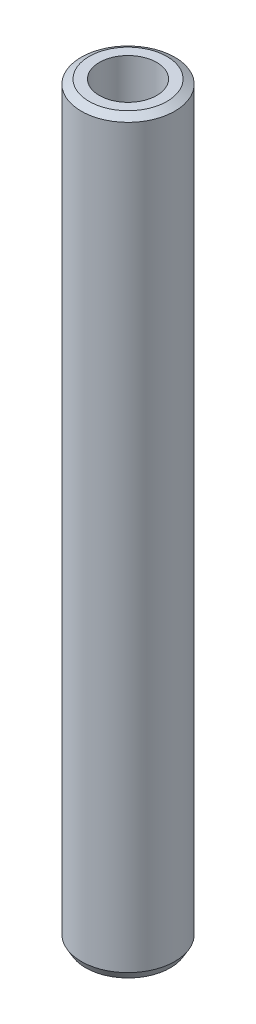
ISO-10303-21;
HEADER;
FILE_DESCRIPTION(('STEP AP214'),'2;1');
FILE_NAME('part.step','',(''),(''),'','','');
FILE_SCHEMA(('AUTOMOTIVE_DESIGN { 1 0 10303 214 1 1 1 1 }'));
ENDSEC;
DATA;
#1=APPLICATION_CONTEXT('core data for automotive mechanical design processes');
#2=APPLICATION_PROTOCOL_DEFINITION('international standard','automotive_design',2000,#1);
#3=PRODUCT_CONTEXT('',#1,'mechanical');
#4=PRODUCT('Part','Part','',(#3));
#5=PRODUCT_RELATED_PRODUCT_CATEGORY('part','',(#4));
#6=PRODUCT_DEFINITION_FORMATION('','',#4);
#7=PRODUCT_DEFINITION_CONTEXT('part definition',#1,'design');
#8=PRODUCT_DEFINITION('design','',#6,#7);
#9=PRODUCT_DEFINITION_SHAPE('','',#8);
#10=(LENGTH_UNIT() NAMED_UNIT(*) SI_UNIT(.MILLI.,.METRE.));
#11=(NAMED_UNIT(*) PLANE_ANGLE_UNIT() SI_UNIT($,.RADIAN.));
#12=(NAMED_UNIT(*) SI_UNIT($,.STERADIAN.) SOLID_ANGLE_UNIT());
#13=UNCERTAINTY_MEASURE_WITH_UNIT(LENGTH_MEASURE(1.E-05),#10,'distance_accuracy_value','');
#14=(GEOMETRIC_REPRESENTATION_CONTEXT(3) GLOBAL_UNCERTAINTY_ASSIGNED_CONTEXT((#13)) GLOBAL_UNIT_ASSIGNED_CONTEXT((#10,
#11,#12)) REPRESENTATION_CONTEXT('',''));
#15=CARTESIAN_POINT('',(0.,0.,0.));
#16=DIRECTION('',(0.,0.,1.));
#17=DIRECTION('',(1.,0.,0.));
#18=AXIS2_PLACEMENT_3D('',#15,#16,#17);
#19=CARTESIAN_POINT('',(0.,600.,0.));
#20=DIRECTION('',(0.,-1.,0.));
#21=DIRECTION('',(0.,0.,-1.));
#22=AXIS2_PLACEMENT_3D('',#19,#20,#21);
#23=CYLINDRICAL_SURFACE('',#22,37.5);
#24=CARTESIAN_POINT('',(0.,596.367724534211,0.));
#25=DIRECTION('',(0.,1.,0.));
#26=DIRECTION('',(0.,0.,1.));
#27=AXIS2_PLACEMENT_3D('',#24,#25,#26);
#28=CIRCLE('',#27,37.5);
#29=CARTESIAN_POINT('',(0.,596.367724534211,-37.5));
#30=VERTEX_POINT('',#29);
#31=EDGE_CURVE('E50',#30,#30,#28,.F.);
#32=CARTESIAN_POINT('',(0.,6.2912856538313,0.));
#33=DIRECTION('',(0.,1.,0.));
#34=DIRECTION('',(0.,0.,1.));
#35=AXIS2_PLACEMENT_3D('',#32,#33,#34);
#36=CIRCLE('',#35,37.5);
#37=CARTESIAN_POINT('',(0.,6.29128565383119,-37.5));
#38=VERTEX_POINT('',#37);
#39=EDGE_CURVE('E51',#38,#38,#36,.T.);
#40=CARTESIAN_POINT('',(0.,596.367724534211,-37.5));
#41=CARTESIAN_POINT('',(0.,590.221094962541,-37.5));
#42=CARTESIAN_POINT('',(0.,584.07446539087,-37.5));
#43=CARTESIAN_POINT('',(0.,571.781206247529,-37.5));
#44=CARTESIAN_POINT('',(0.,565.634576675858,-37.5));
#45=CARTESIAN_POINT('',(0.,553.341317532517,-37.5));
#46=CARTESIAN_POINT('',(0.,547.194687960847,-37.5));
#47=CARTESIAN_POINT('',(0.,534.901428817505,-37.5));
#48=CARTESIAN_POINT('',(0.,528.754799245835,-37.5));
#49=CARTESIAN_POINT('',(0.,516.461540102493,-37.5));
#50=CARTESIAN_POINT('',(0.,510.314910530823,-37.5));
#51=CARTESIAN_POINT('',(0.,498.021651387481,-37.5));
#52=CARTESIAN_POINT('',(0.,491.875021815811,-37.5));
#53=CARTESIAN_POINT('',(0.,479.581762672469,-37.5));
#54=CARTESIAN_POINT('',(0.,473.435133100799,-37.5));
#55=CARTESIAN_POINT('',(0.,461.141873957458,-37.5));
#56=CARTESIAN_POINT('',(0.,454.995244385787,-37.5));
#57=CARTESIAN_POINT('',(0.,442.701985242446,-37.5));
#58=CARTESIAN_POINT('',(0.,436.555355670775,-37.5));
#59=CARTESIAN_POINT('',(0.,424.262096527434,-37.5));
#60=CARTESIAN_POINT('',(0.,418.115466955763,-37.5));
#61=CARTESIAN_POINT('',(0.,405.822207812422,-37.5));
#62=CARTESIAN_POINT('',(0.,399.675578240751,-37.5));
#63=CARTESIAN_POINT('',(0.,387.38231909741,-37.5));
#64=CARTESIAN_POINT('',(0.,381.235689525739,-37.5));
#65=CARTESIAN_POINT('',(0.,368.942430382398,-37.5));
#66=CARTESIAN_POINT('',(0.,362.795800810728,-37.5));
#67=CARTESIAN_POINT('',(0.,350.502541667386,-37.5));
#68=CARTESIAN_POINT('',(0.,344.355912095716,-37.5));
#69=CARTESIAN_POINT('',(0.,332.062652952374,-37.5));
#70=CARTESIAN_POINT('',(0.,325.916023380704,-37.5));
#71=CARTESIAN_POINT('',(0.,313.622764237363,-37.5));
#72=CARTESIAN_POINT('',(0.,307.476134665692,-37.5));
#73=CARTESIAN_POINT('',(0.,295.182875522351,-37.5));
#74=CARTESIAN_POINT('',(0.,289.03624595068,-37.5));
#75=CARTESIAN_POINT('',(0.,276.742986807339,-37.5));
#76=CARTESIAN_POINT('',(0.,270.596357235668,-37.5));
#77=CARTESIAN_POINT('',(0.,258.303098092327,-37.5));
#78=CARTESIAN_POINT('',(0.,252.156468520656,-37.5));
#79=CARTESIAN_POINT('',(0.,239.863209377315,-37.5));
#80=CARTESIAN_POINT('',(0.,233.716579805644,-37.5));
#81=CARTESIAN_POINT('',(0.,221.423320662303,-37.5));
#82=CARTESIAN_POINT('',(0.,215.276691090632,-37.5));
#83=CARTESIAN_POINT('',(0.,202.983431947291,-37.5));
#84=CARTESIAN_POINT('',(0.,196.836802375621,-37.5));
#85=CARTESIAN_POINT('',(0.,184.543543232279,-37.5));
#86=CARTESIAN_POINT('',(0.,178.396913660609,-37.5));
#87=CARTESIAN_POINT('',(0.,166.103654517267,-37.5));
#88=CARTESIAN_POINT('',(0.,159.957024945597,-37.5));
#89=CARTESIAN_POINT('',(0.,147.663765802256,-37.5));
#90=CARTESIAN_POINT('',(0.,141.517136230585,-37.5));
#91=CARTESIAN_POINT('',(0.,129.223877087244,-37.5));
#92=CARTESIAN_POINT('',(0.,123.077247515573,-37.5));
#93=CARTESIAN_POINT('',(0.,110.783988372232,-37.5));
#94=CARTESIAN_POINT('',(0.,104.637358800561,-37.5));
#95=CARTESIAN_POINT('',(0.,92.34409965722,-37.5));
#96=CARTESIAN_POINT('',(0.,86.1974700855494,-37.5));
#97=CARTESIAN_POINT('',(0.,73.9042109422082,-37.5));
#98=CARTESIAN_POINT('',(0.,67.7575813705375,-37.5));
#99=CARTESIAN_POINT('',(0.,55.4643222271963,-37.5));
#100=CARTESIAN_POINT('',(0.,49.3176926555256,-37.5));
#101=CARTESIAN_POINT('',(0.,37.0244335121844,-37.5));
#102=CARTESIAN_POINT('',(0.,30.8778039405137,-37.5));
#103=CARTESIAN_POINT('',(0.,18.5845447971725,-37.5));
#104=CARTESIAN_POINT('',(0.,12.4379152255018,-37.5));
#105=CARTESIAN_POINT('',(0.,6.29128565383119,-37.5));
#106=B_SPLINE_CURVE_WITH_KNOTS('',3,(#40,#41,#42,#43,#44,#45,#46,#47,#48,#49,#50,#51,#52,#53,
#54,#55,#56,#57,#58,#59,#60,#61,#62,#63,#64,#65,#66,#67,#68,#69,#70,#71,#72,#73,#74,#75,#76,#77,
#78,#79,#80,#81,#82,#83,#84,#85,#86,#87,#88,#89,#90,#91,#92,#93,#94,#95,#96,#97,#98,#99,#100,
#101,#102,#103,#104,#105),.UNSPECIFIED.,.F.,.F.,(4,2,2,2,2,2,2,2,2,2,2,2,2,2,2,2,2,2,2,2,2,2,2,
2,2,2,2,2,2,2,2,2,4),(0.,18.4398887150118,36.8797774300237,55.3196661450356,73.7595548600475,
92.1994435750594,110.639332290071,129.079221005083,147.519109720095,165.958998435107,
184.398887150119,202.838775865131,221.278664580143,239.718553295154,258.158442010166,
276.598330725178,295.03821944019,313.478108155202,331.917996870214,350.357885585226,
368.797774300238,387.23766301525,405.677551730261,424.117440445273,442.557329160285,
460.997217875297,479.437106590309,497.876995305321,516.316884020333,534.756772735344,
553.196661450356,571.636550165368,590.07643888038),.UNSPECIFIED.);
#107=EDGE_CURVE('BSEAM39',#30,#38,#106,.T.);
#108=ORIENTED_EDGE('',*,*,#31,.T.);
#109=ORIENTED_EDGE('',*,*,#39,.T.);
#110=ORIENTED_EDGE('',*,*,#107,.T.);
#111=ORIENTED_EDGE('',*,*,#107,.F.);
#112=EDGE_LOOP('',(#108,#110,#109,#111));
#113=FACE_BOUND('',#112,.T.);
#114=ADVANCED_FACE('F39',(#113),#23,.T.);
#115=CARTESIAN_POINT('',(0.,600.,0.));
#116=DIRECTION('',(0.,1.,0.));
#117=DIRECTION('',(0.,0.,1.));
#118=AXIS2_PLACEMENT_3D('',#115,#116,#117);
#119=PLANE('',#118);
#120=CARTESIAN_POINT('',(0.,600.,0.));
#121=DIRECTION('',(0.,1.,0.));
#122=DIRECTION('',(0.,0.,1.));
#123=AXIS2_PLACEMENT_3D('',#120,#121,#122);
#124=CIRCLE('',#123,31.2087143461686);
#125=CARTESIAN_POINT('',(0.,600.,-31.2087143461687));
#126=VERTEX_POINT('',#125);
#127=EDGE_CURVE('E54',#126,#126,#124,.T.);
#128=ORIENTED_EDGE('',*,*,#127,.T.);
#129=EDGE_LOOP('',(#128));
#130=FACE_BOUND('',#129,.T.);
#131=CARTESIAN_POINT('',(0.,600.,0.));
#132=DIRECTION('',(0.,1.,0.));
#133=DIRECTION('',(0.,0.,1.));
#134=AXIS2_PLACEMENT_3D('',#131,#132,#133);
#135=CIRCLE('',#134,22.9926477397774);
#136=CARTESIAN_POINT('',(0.,600.,22.9926477397774));
#137=VERTEX_POINT('',#136);
#138=EDGE_CURVE('E58',#137,#137,#135,.T.);
#139=ORIENTED_EDGE('',*,*,#138,.F.);
#140=EDGE_LOOP('',(#139));
#141=FACE_BOUND('',#140,.T.);
#142=ADVANCED_FACE('F69',(#130,#141),#119,.T.);
#143=CARTESIAN_POINT('',(0.,0.,0.));
#144=DIRECTION('',(0.,1.,0.));
#145=DIRECTION('',(0.,0.,1.));
#146=AXIS2_PLACEMENT_3D('',#143,#144,#145);
#147=PLANE('',#146);
#148=CARTESIAN_POINT('',(0.,0.,0.));
#149=DIRECTION('',(0.,1.,0.));
#150=DIRECTION('',(0.,0.,1.));
#151=AXIS2_PLACEMENT_3D('',#148,#149,#150);
#152=CIRCLE('',#151,33.8677245342117);
#153=CARTESIAN_POINT('',(0.,0.,33.8677245342117));
#154=VERTEX_POINT('',#153);
#155=EDGE_CURVE('E10',#154,#154,#152,.F.);
#156=ORIENTED_EDGE('',*,*,#155,.T.);
#157=EDGE_LOOP('',(#156));
#158=FACE_BOUND('',#157,.T.);
#159=CARTESIAN_POINT('',(0.,0.,0.));
#160=DIRECTION('',(0.,1.,0.));
#161=DIRECTION('',(0.,0.,1.));
#162=AXIS2_PLACEMENT_3D('',#159,#160,#161);
#163=CIRCLE('',#162,22.9926477397774);
#164=CARTESIAN_POINT('',(0.,0.,22.9926477397774));
#165=VERTEX_POINT('',#164);
#166=EDGE_CURVE('E63',#165,#165,#163,.T.);
#167=ORIENTED_EDGE('',*,*,#166,.T.);
#168=EDGE_LOOP('',(#167));
#169=FACE_BOUND('',#168,.T.);
#170=ADVANCED_FACE('F75',(#158,#169),#147,.F.);
#171=CARTESIAN_POINT('',(0.,600.,0.));
#172=DIRECTION('',(0.,-1.,0.));
#173=DIRECTION('',(0.,0.,-1.));
#174=AXIS2_PLACEMENT_3D('',#171,#172,#173);
#175=CYLINDRICAL_SURFACE('',#174,22.9926477397774);
#176=ORIENTED_EDGE('',*,*,#138,.T.);
#177=EDGE_LOOP('',(#176));
#178=FACE_BOUND('',#177,.T.);
#179=ORIENTED_EDGE('',*,*,#166,.F.);
#180=EDGE_LOOP('',(#179));
#181=FACE_BOUND('',#180,.T.);
#182=ADVANCED_FACE('F70',(#178,#181),#175,.F.);
#183=CARTESIAN_POINT('',(0.,600.,0.));
#184=DIRECTION('',(0.,-1.,0.));
#185=DIRECTION('',(0.,0.,-1.));
#186=AXIS2_PLACEMENT_3D('',#183,#184,#185);
#187=CONICAL_SURFACE('',#186,31.2087143461686,1.04719755119659);
#188=CARTESIAN_POINT('',(0.,596.367724534211,-37.5000000000001));
#189=CARTESIAN_POINT('',(0.,596.40556073698,-37.4344657744393));
#190=CARTESIAN_POINT('',(0.,596.443396939749,-37.3689315488786));
#191=CARTESIAN_POINT('',(0.,596.519069345286,-37.2378630977571));
#192=CARTESIAN_POINT('',(0.,596.556905548055,-37.1723288721964));
#193=CARTESIAN_POINT('',(0.,596.632577953592,-37.0412604210749));
#194=CARTESIAN_POINT('',(0.,596.67041415636,-36.9757261955141));
#195=CARTESIAN_POINT('',(0.,596.746086561898,-36.8446577443927));
#196=CARTESIAN_POINT('',(0.,596.783922764666,-36.7791235188319));
#197=CARTESIAN_POINT('',(0.,596.859595170204,-36.6480550677104));
#198=CARTESIAN_POINT('',(0.,596.897431372972,-36.5825208421497));
#199=CARTESIAN_POINT('',(0.,596.97310377851,-36.4514523910282));
#200=CARTESIAN_POINT('',(0.,597.010939981278,-36.3859181654675));
#201=CARTESIAN_POINT('',(0.,597.086612386815,-36.254849714346));
#202=CARTESIAN_POINT('',(0.,597.124448589584,-36.1893154887852));
#203=CARTESIAN_POINT('',(0.,597.200120995121,-36.0582470376637));
#204=CARTESIAN_POINT('',(0.,597.23795719789,-35.992712812103));
#205=CARTESIAN_POINT('',(0.,597.313629603427,-35.8616443609815));
#206=CARTESIAN_POINT('',(0.,597.351465806196,-35.7961101354207));
#207=CARTESIAN_POINT('',(0.,597.427138211733,-35.6650416842993));
#208=CARTESIAN_POINT('',(0.,597.464974414502,-35.5995074587385));
#209=CARTESIAN_POINT('',(0.,597.540646820039,-35.468439007617));
#210=CARTESIAN_POINT('',(0.,597.578483022808,-35.4029047820563));
#211=CARTESIAN_POINT('',(0.,597.654155428345,-35.2718363309348));
#212=CARTESIAN_POINT('',(0.,597.691991631114,-35.2063021053741));
#213=CARTESIAN_POINT('',(0.,597.767664036651,-35.0752336542526));
#214=CARTESIAN_POINT('',(0.,597.805500239419,-35.0096994286918));
#215=CARTESIAN_POINT('',(0.,597.881172644957,-34.8786309775703));
#216=CARTESIAN_POINT('',(0.,597.919008847725,-34.8130967520096));
#217=CARTESIAN_POINT('',(0.,597.994681253263,-34.6820283008881));
#218=CARTESIAN_POINT('',(0.,598.032517456031,-34.6164940753274));
#219=CARTESIAN_POINT('',(0.,598.108189861568,-34.4854256242059));
#220=CARTESIAN_POINT('',(0.,598.146026064337,-34.4198913986451));
#221=CARTESIAN_POINT('',(0.,598.221698469874,-34.2888229475236));
#222=CARTESIAN_POINT('',(0.,598.259534672643,-34.2232887219629));
#223=CARTESIAN_POINT('',(0.,598.33520707818,-34.0922202708414));
#224=CARTESIAN_POINT('',(0.,598.373043280949,-34.0266860452807));
#225=CARTESIAN_POINT('',(0.,598.448715686486,-33.8956175941592));
#226=CARTESIAN_POINT('',(0.,598.486551889255,-33.8300833685984));
#227=CARTESIAN_POINT('',(0.,598.562224294792,-33.6990149174769));
#228=CARTESIAN_POINT('',(0.,598.600060497561,-33.6334806919162));
#229=CARTESIAN_POINT('',(0.,598.675732903098,-33.5024122407947));
#230=CARTESIAN_POINT('',(0.,598.713569105866,-33.436878015234));
#231=CARTESIAN_POINT('',(0.,598.789241511404,-33.3058095641125));
#232=CARTESIAN_POINT('',(0.,598.827077714172,-33.2402753385517));
#233=CARTESIAN_POINT('',(0.,598.90275011971,-33.1092068874302));
#234=CARTESIAN_POINT('',(0.,598.940586322478,-33.0436726618695));
#235=CARTESIAN_POINT('',(0.,599.016258728016,-32.912604210748));
#236=CARTESIAN_POINT('',(0.,599.054094930784,-32.8470699851873));
#237=CARTESIAN_POINT('',(0.,599.129767336321,-32.7160015340658));
#238=CARTESIAN_POINT('',(0.,599.16760353909,-32.650467308505));
#239=CARTESIAN_POINT('',(0.,599.243275944627,-32.5193988573835));
#240=CARTESIAN_POINT('',(0.,599.281112147396,-32.4538646318228));
#241=CARTESIAN_POINT('',(0.,599.356784552933,-32.3227961807013));
#242=CARTESIAN_POINT('',(0.,599.394620755702,-32.2572619551406));
#243=CARTESIAN_POINT('',(0.,599.470293161239,-32.1261935040191));
#244=CARTESIAN_POINT('',(0.,599.508129364008,-32.0606592784583));
#245=CARTESIAN_POINT('',(0.,599.583801769545,-31.9295908273369));
#246=CARTESIAN_POINT('',(0.,599.621637972314,-31.8640566017761));
#247=CARTESIAN_POINT('',(0.,599.697310377851,-31.7329881506546));
#248=CARTESIAN_POINT('',(0.,599.73514658062,-31.6674539250939));
#249=CARTESIAN_POINT('',(0.,599.810818986157,-31.5363854739724));
#250=CARTESIAN_POINT('',(0.,599.848655188925,-31.4708512484116));
#251=CARTESIAN_POINT('',(0.,599.924327594463,-31.3397827972901));
#252=CARTESIAN_POINT('',(0.,599.962163797231,-31.2742485717294));
#253=CARTESIAN_POINT('',(0.,600.,-31.2087143461687));
#254=B_SPLINE_CURVE_WITH_KNOTS('',3,(#188,#189,#190,#191,#192,#193,#194,#195,#196,#197,#198,
#199,#200,#201,#202,#203,#204,#205,#206,#207,#208,#209,#210,#211,#212,#213,#214,#215,#216,#217,
#218,#219,#220,#221,#222,#223,#224,#225,#226,#227,#228,#229,#230,#231,#232,#233,#234,#235,#236,
#237,#238,#239,#240,#241,#242,#243,#244,#245,#246,#247,#248,#249,#250,#251,#252,#253),
.UNSPECIFIED.,.F.,.F.,(4,2,2,2,2,2,2,2,2,2,2,2,2,2,2,2,2,2,2,2,2,2,2,2,2,2,2,2,2,2,2,2,4),(0.,
0.227017216611751,0.454034433223552,0.681051649835304,0.908068866447104,1.13508608305886,
1.36210329967066,1.58912051628241,1.81613773289422,2.04315494950597,2.27017216611777,
2.49718938272952,2.72420659934133,2.95122381595307,3.17824103256488,3.40525824917662,
3.63227546578843,3.85929268240018,4.08630989901198,4.31332711562373,4.54034433223554,
4.76736154884729,4.99437876545909,5.22139598207084,5.44841319868265,5.6754304152944,
5.9024476319062,6.12946484851795,6.35648206512976,6.5834992817415,6.81051649835331,
7.03753371496506,7.26455093157686),.UNSPECIFIED.);
#255=EDGE_CURVE('BSEAM81',#30,#126,#254,.T.);
#256=ORIENTED_EDGE('',*,*,#31,.F.);
#257=ORIENTED_EDGE('',*,*,#127,.F.);
#258=ORIENTED_EDGE('',*,*,#255,.T.);
#259=ORIENTED_EDGE('',*,*,#255,.F.);
#260=EDGE_LOOP('',(#256,#258,#257,#259));
#261=FACE_BOUND('',#260,.T.);
#262=ADVANCED_FACE('F81',(#261),#187,.T.);
#263=CARTESIAN_POINT('',(0.,6.2912856538313,0.));
#264=DIRECTION('',(0.,1.,0.));
#265=DIRECTION('',(0.,0.,1.));
#266=AXIS2_PLACEMENT_3D('',#263,#264,#265);
#267=CONICAL_SURFACE('',#266,37.5,0.5235987755983);
#268=ORIENTED_EDGE('',*,*,#155,.F.);
#269=EDGE_LOOP('',(#268));
#270=FACE_BOUND('',#269,.T.);
#271=ORIENTED_EDGE('',*,*,#39,.F.);
#272=EDGE_LOOP('',(#271));
#273=FACE_BOUND('',#272,.T.);
#274=ADVANCED_FACE('F45',(#270,#273),#267,.T.);
#275=CLOSED_SHELL('',(#114,#142,#170,#182,#262,#274));
#276=MANIFOLD_SOLID_BREP('B2',#275);
#277=ADVANCED_BREP_SHAPE_REPRESENTATION('',(#18,#276),#14);
#278=SHAPE_DEFINITION_REPRESENTATION(#9,#277);
ENDSEC;
END-ISO-10303-21;
